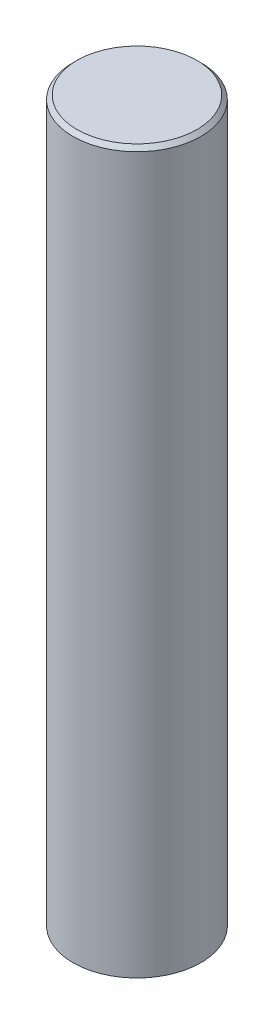
ISO-10303-21;
HEADER;
FILE_DESCRIPTION(('STEP AP214'),'2;1');
FILE_NAME('part.step','',(''),(''),'','','');
FILE_SCHEMA(('AUTOMOTIVE_DESIGN { 1 0 10303 214 1 1 1 1 }'));
ENDSEC;
DATA;
#1=APPLICATION_CONTEXT('core data for automotive mechanical design processes');
#2=APPLICATION_PROTOCOL_DEFINITION('international standard','automotive_design',2000,#1);
#3=PRODUCT_CONTEXT('',#1,'mechanical');
#4=PRODUCT('Part','Part','',(#3));
#5=PRODUCT_RELATED_PRODUCT_CATEGORY('part','',(#4));
#6=PRODUCT_DEFINITION_FORMATION('','',#4);
#7=PRODUCT_DEFINITION_CONTEXT('part definition',#1,'design');
#8=PRODUCT_DEFINITION('design','',#6,#7);
#9=PRODUCT_DEFINITION_SHAPE('','',#8);
#10=(LENGTH_UNIT() NAMED_UNIT(*) SI_UNIT(.MILLI.,.METRE.));
#11=(NAMED_UNIT(*) PLANE_ANGLE_UNIT() SI_UNIT($,.RADIAN.));
#12=(NAMED_UNIT(*) SI_UNIT($,.STERADIAN.) SOLID_ANGLE_UNIT());
#13=UNCERTAINTY_MEASURE_WITH_UNIT(LENGTH_MEASURE(1.E-05),#10,'distance_accuracy_value','');
#14=(GEOMETRIC_REPRESENTATION_CONTEXT(3) GLOBAL_UNCERTAINTY_ASSIGNED_CONTEXT((#13)) GLOBAL_UNIT_ASSIGNED_CONTEXT((#10,
#11,#12)) REPRESENTATION_CONTEXT('',''));
#15=CARTESIAN_POINT('',(0.,0.,0.));
#16=DIRECTION('',(0.,0.,1.));
#17=DIRECTION('',(1.,0.,0.));
#18=AXIS2_PLACEMENT_3D('',#15,#16,#17);
#19=CARTESIAN_POINT('',(0.,180.,0.));
#20=DIRECTION('',(0.,-1.,0.));
#21=DIRECTION('',(0.,0.,-1.));
#22=AXIS2_PLACEMENT_3D('',#19,#20,#21);
#23=CYLINDRICAL_SURFACE('',#22,16.);
#24=CARTESIAN_POINT('',(0.,179.,0.));
#25=DIRECTION('',(0.,1.,0.));
#26=DIRECTION('',(0.,0.,1.));
#27=AXIS2_PLACEMENT_3D('',#24,#25,#26);
#28=CIRCLE('',#27,16.);
#29=CARTESIAN_POINT('',(0.,179.,16.));
#30=VERTEX_POINT('',#29);
#31=EDGE_CURVE('E10',#30,#30,#28,.F.);
#32=ORIENTED_EDGE('',*,*,#31,.T.);
#33=EDGE_LOOP('',(#32));
#34=FACE_BOUND('',#33,.T.);
#35=CARTESIAN_POINT('',(0.,0.,0.));
#36=DIRECTION('',(0.,1.,0.));
#37=DIRECTION('',(0.,0.,1.));
#38=AXIS2_PLACEMENT_3D('',#35,#36,#37);
#39=CIRCLE('',#38,16.);
#40=CARTESIAN_POINT('',(0.,0.,16.));
#41=VERTEX_POINT('',#40);
#42=EDGE_CURVE('E41',#41,#41,#39,.T.);
#43=ORIENTED_EDGE('',*,*,#42,.T.);
#44=EDGE_LOOP('',(#43));
#45=FACE_BOUND('',#44,.T.);
#46=ADVANCED_FACE('F30',(#34,#45),#23,.T.);
#47=CARTESIAN_POINT('',(0.,180.,0.));
#48=DIRECTION('',(0.,1.,0.));
#49=DIRECTION('',(0.,0.,1.));
#50=AXIS2_PLACEMENT_3D('',#47,#48,#49);
#51=PLANE('',#50);
#52=CARTESIAN_POINT('',(0.,180.,0.));
#53=DIRECTION('',(0.,1.,0.));
#54=DIRECTION('',(0.,0.,1.));
#55=AXIS2_PLACEMENT_3D('',#52,#53,#54);
#56=CIRCLE('',#55,15.0000000000001);
#57=CARTESIAN_POINT('',(0.,180.,15.0000000000001));
#58=VERTEX_POINT('',#57);
#59=EDGE_CURVE('E37',#58,#58,#56,.T.);
#60=ORIENTED_EDGE('',*,*,#59,.T.);
#61=EDGE_LOOP('',(#60));
#62=FACE_BOUND('',#61,.T.);
#63=ADVANCED_FACE('F51',(#62),#51,.T.);
#64=CARTESIAN_POINT('',(0.,0.,0.));
#65=DIRECTION('',(0.,1.,0.));
#66=DIRECTION('',(0.,0.,1.));
#67=AXIS2_PLACEMENT_3D('',#64,#65,#66);
#68=PLANE('',#67);
#69=ORIENTED_EDGE('',*,*,#42,.F.);
#70=EDGE_LOOP('',(#69));
#71=FACE_BOUND('',#70,.T.);
#72=ADVANCED_FACE('F49',(#71),#68,.F.);
#73=CARTESIAN_POINT('',(0.,180.,0.));
#74=DIRECTION('',(0.,-1.,0.));
#75=DIRECTION('',(0.,0.,-1.));
#76=AXIS2_PLACEMENT_3D('',#73,#74,#75);
#77=CONICAL_SURFACE('',#76,15.0000000000001,0.785398163397429);
#78=ORIENTED_EDGE('',*,*,#31,.F.);
#79=EDGE_LOOP('',(#78));
#80=FACE_BOUND('',#79,.T.);
#81=ORIENTED_EDGE('',*,*,#59,.F.);
#82=EDGE_LOOP('',(#81));
#83=FACE_BOUND('',#82,.T.);
#84=ADVANCED_FACE('F32',(#80,#83),#77,.T.);
#85=CLOSED_SHELL('',(#46,#63,#72,#84));
#86=MANIFOLD_SOLID_BREP('B2',#85);
#87=ADVANCED_BREP_SHAPE_REPRESENTATION('',(#18,#86),#14);
#88=SHAPE_DEFINITION_REPRESENTATION(#9,#87);
ENDSEC;
END-ISO-10303-21;
